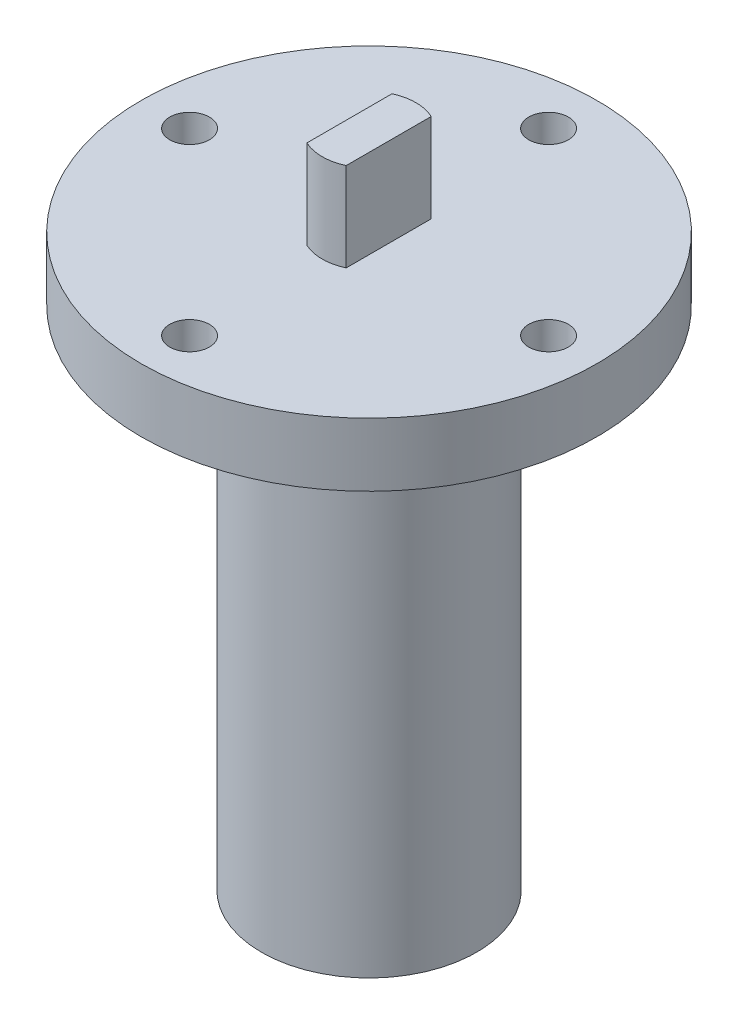
ISO-10303-21;
HEADER;
FILE_DESCRIPTION(('STEP AP214'),'2;1');
FILE_NAME('part.step','',(''),(''),'','','');
FILE_SCHEMA(('AUTOMOTIVE_DESIGN { 1 0 10303 214 1 1 1 1 }'));
ENDSEC;
DATA;
#1=APPLICATION_CONTEXT('core data for automotive mechanical design processes');
#2=APPLICATION_PROTOCOL_DEFINITION('international standard','automotive_design',2000,#1);
#3=PRODUCT_CONTEXT('',#1,'mechanical');
#4=PRODUCT('Part','Part','',(#3));
#5=PRODUCT_RELATED_PRODUCT_CATEGORY('part','',(#4));
#6=PRODUCT_DEFINITION_FORMATION('','',#4);
#7=PRODUCT_DEFINITION_CONTEXT('part definition',#1,'design');
#8=PRODUCT_DEFINITION('design','',#6,#7);
#9=PRODUCT_DEFINITION_SHAPE('','',#8);
#10=(LENGTH_UNIT() NAMED_UNIT(*) SI_UNIT(.MILLI.,.METRE.));
#11=(NAMED_UNIT(*) PLANE_ANGLE_UNIT() SI_UNIT($,.RADIAN.));
#12=(NAMED_UNIT(*) SI_UNIT($,.STERADIAN.) SOLID_ANGLE_UNIT());
#13=UNCERTAINTY_MEASURE_WITH_UNIT(LENGTH_MEASURE(1.E-05),#10,'distance_accuracy_value','');
#14=(GEOMETRIC_REPRESENTATION_CONTEXT(3) GLOBAL_UNCERTAINTY_ASSIGNED_CONTEXT((#13)) GLOBAL_UNIT_ASSIGNED_CONTEXT((#10,
#11,#12)) REPRESENTATION_CONTEXT('',''));
#15=CARTESIAN_POINT('',(0.,0.,0.));
#16=DIRECTION('',(0.,0.,1.));
#17=DIRECTION('',(1.,0.,0.));
#18=AXIS2_PLACEMENT_3D('',#15,#16,#17);
#19=CARTESIAN_POINT('',(0.,6.35,0.));
#20=DIRECTION('',(0.,1.,0.));
#21=DIRECTION('',(0.,0.,1.));
#22=AXIS2_PLACEMENT_3D('',#19,#20,#21);
#23=PLANE('',#22);
#24=CARTESIAN_POINT('',(18.,6.35,-1.88539992297529E-13));
#25=DIRECTION('',(0.,1.,0.));
#26=DIRECTION('',(0.,0.,1.));
#27=AXIS2_PLACEMENT_3D('',#24,#25,#26);
#28=CIRCLE('',#27,1.984375);
#29=CARTESIAN_POINT('',(18.,6.35,1.98437499999981));
#30=VERTEX_POINT('',#29);
#31=EDGE_CURVE('E217',#30,#30,#28,.T.);
#32=ORIENTED_EDGE('',*,*,#31,.F.);
#33=EDGE_LOOP('',(#32));
#34=FACE_BOUND('',#33,.T.);
#35=CARTESIAN_POINT('',(0.,6.35,18.));
#36=DIRECTION('',(0.,1.,0.));
#37=DIRECTION('',(0.,0.,1.));
#38=AXIS2_PLACEMENT_3D('',#35,#36,#37);
#39=CIRCLE('',#38,1.984375);
#40=CARTESIAN_POINT('',(0.,6.35,19.984375));
#41=VERTEX_POINT('',#40);
#42=EDGE_CURVE('E211',#41,#41,#39,.T.);
#43=ORIENTED_EDGE('',*,*,#42,.F.);
#44=EDGE_LOOP('',(#43));
#45=FACE_BOUND('',#44,.T.);
#46=CARTESIAN_POINT('',(-18.,6.35,0.));
#47=DIRECTION('',(0.,1.,0.));
#48=DIRECTION('',(0.,0.,1.));
#49=AXIS2_PLACEMENT_3D('',#46,#47,#48);
#50=CIRCLE('',#49,1.984375);
#51=CARTESIAN_POINT('',(-18.,6.35,1.98437500000006));
#52=VERTEX_POINT('',#51);
#53=EDGE_CURVE('E205',#52,#52,#50,.T.);
#54=ORIENTED_EDGE('',*,*,#53,.F.);
#55=EDGE_LOOP('',(#54));
#56=FACE_BOUND('',#55,.T.);
#57=CARTESIAN_POINT('',(0.,6.35,-18.));
#58=DIRECTION('',(0.,1.,0.));
#59=DIRECTION('',(0.,0.,1.));
#60=AXIS2_PLACEMENT_3D('',#57,#58,#59);
#61=CIRCLE('',#60,1.984375);
#62=CARTESIAN_POINT('',(0.,6.35,-16.015625));
#63=VERTEX_POINT('',#62);
#64=EDGE_CURVE('E196',#63,#63,#61,.T.);
#65=ORIENTED_EDGE('',*,*,#64,.F.);
#66=EDGE_LOOP('',(#65));
#67=FACE_BOUND('',#66,.T.);
#68=CARTESIAN_POINT('',(0.,6.35,0.));
#69=DIRECTION('',(0.,1.,0.));
#70=DIRECTION('',(0.,0.,1.));
#71=AXIS2_PLACEMENT_3D('',#68,#69,#70);
#72=CIRCLE('',#71,22.86);
#73=CARTESIAN_POINT('',(0.,6.35,22.86));
#74=VERTEX_POINT('',#73);
#75=EDGE_CURVE('E130',#74,#74,#72,.T.);
#76=ORIENTED_EDGE('',*,*,#75,.T.);
#77=EDGE_LOOP('',(#76));
#78=FACE_BOUND('',#77,.T.);
#79=CARTESIAN_POINT('',(0.,6.35,0.));
#80=DIRECTION('',(0.,1.,0.));
#81=DIRECTION('',(0.,0.,1.));
#82=AXIS2_PLACEMENT_3D('',#79,#80,#81);
#83=CIRCLE('',#82,4.699);
#84=CARTESIAN_POINT('',(1.9685,6.35,-4.26680310654242));
#85=VERTEX_POINT('',#84);
#86=CARTESIAN_POINT('',(-1.9685,6.35,-4.26680310654242));
#87=VERTEX_POINT('',#86);
#88=EDGE_CURVE('E109',#85,#87,#83,.T.);
#89=ORIENTED_EDGE('',*,*,#88,.F.);
#90=DIRECTION('',(0.,0.,1.));
#91=VECTOR('',#90,1.);
#92=CARTESIAN_POINT('',(1.9685,6.35,0.));
#93=LINE('',#92,#91);
#94=CARTESIAN_POINT('',(1.9685,6.35,4.26680310654242));
#95=VERTEX_POINT('',#94);
#96=EDGE_CURVE('E55',#85,#95,#93,.T.);
#97=ORIENTED_EDGE('',*,*,#96,.T.);
#98=CARTESIAN_POINT('',(-1.9685,6.35,4.26680310654241));
#99=VERTEX_POINT('',#98);
#100=EDGE_CURVE('E60',#99,#95,#83,.T.);
#101=ORIENTED_EDGE('',*,*,#100,.F.);
#102=DIRECTION('',(0.,0.,1.));
#103=VECTOR('',#102,1.);
#104=CARTESIAN_POINT('',(-1.9685,6.35,0.));
#105=LINE('',#104,#103);
#106=EDGE_CURVE('E107',#87,#99,#105,.T.);
#107=ORIENTED_EDGE('',*,*,#106,.F.);
#108=EDGE_LOOP('',(#89,#97,#101,#107));
#109=FACE_BOUND('',#108,.T.);
#110=ADVANCED_FACE('F39',(#34,#45,#56,#67,#78,#109),#23,.T.);
#111=CARTESIAN_POINT('',(0.,6.35,0.));
#112=DIRECTION('',(0.,-1.,0.));
#113=DIRECTION('',(0.,0.,-1.));
#114=AXIS2_PLACEMENT_3D('',#111,#112,#113);
#115=CYLINDRICAL_SURFACE('',#114,22.86);
#116=ORIENTED_EDGE('',*,*,#75,.F.);
#117=EDGE_LOOP('',(#116));
#118=FACE_BOUND('',#117,.T.);
#119=CARTESIAN_POINT('',(0.,0.,0.));
#120=DIRECTION('',(0.,1.,0.));
#121=DIRECTION('',(0.,0.,1.));
#122=AXIS2_PLACEMENT_3D('',#119,#120,#121);
#123=CIRCLE('',#122,22.86);
#124=CARTESIAN_POINT('',(0.,0.,22.86));
#125=VERTEX_POINT('',#124);
#126=EDGE_CURVE('E88',#125,#125,#123,.T.);
#127=ORIENTED_EDGE('',*,*,#126,.T.);
#128=EDGE_LOOP('',(#127));
#129=FACE_BOUND('',#128,.T.);
#130=ADVANCED_FACE('F158',(#118,#129),#115,.T.);
#131=CARTESIAN_POINT('',(0.,0.,0.));
#132=DIRECTION('',(0.,1.,0.));
#133=DIRECTION('',(0.,0.,1.));
#134=AXIS2_PLACEMENT_3D('',#131,#132,#133);
#135=PLANE('',#134);
#136=CARTESIAN_POINT('',(18.,0.,-1.88539992297529E-13));
#137=DIRECTION('',(0.,1.,0.));
#138=DIRECTION('',(0.,0.,1.));
#139=AXIS2_PLACEMENT_3D('',#136,#137,#138);
#140=CIRCLE('',#139,1.984375);
#141=CARTESIAN_POINT('',(18.,0.,1.98437499999981));
#142=VERTEX_POINT('',#141);
#143=EDGE_CURVE('E179',#142,#142,#140,.T.);
#144=ORIENTED_EDGE('',*,*,#143,.T.);
#145=EDGE_LOOP('',(#144));
#146=FACE_BOUND('',#145,.T.);
#147=CARTESIAN_POINT('',(0.,0.,18.));
#148=DIRECTION('',(0.,1.,0.));
#149=DIRECTION('',(0.,0.,1.));
#150=AXIS2_PLACEMENT_3D('',#147,#148,#149);
#151=CIRCLE('',#150,1.984375);
#152=CARTESIAN_POINT('',(0.,0.,19.984375));
#153=VERTEX_POINT('',#152);
#154=EDGE_CURVE('E183',#153,#153,#151,.T.);
#155=ORIENTED_EDGE('',*,*,#154,.T.);
#156=EDGE_LOOP('',(#155));
#157=FACE_BOUND('',#156,.T.);
#158=CARTESIAN_POINT('',(-18.,0.,0.));
#159=DIRECTION('',(0.,1.,0.));
#160=DIRECTION('',(0.,0.,1.));
#161=AXIS2_PLACEMENT_3D('',#158,#159,#160);
#162=CIRCLE('',#161,1.984375);
#163=CARTESIAN_POINT('',(-18.,0.,1.98437500000006));
#164=VERTEX_POINT('',#163);
#165=EDGE_CURVE('E187',#164,#164,#162,.T.);
#166=ORIENTED_EDGE('',*,*,#165,.T.);
#167=EDGE_LOOP('',(#166));
#168=FACE_BOUND('',#167,.T.);
#169=CARTESIAN_POINT('',(0.,0.,-18.));
#170=DIRECTION('',(0.,1.,0.));
#171=DIRECTION('',(0.,0.,1.));
#172=AXIS2_PLACEMENT_3D('',#169,#170,#171);
#173=CIRCLE('',#172,1.984375);
#174=CARTESIAN_POINT('',(0.,0.,-16.015625));
#175=VERTEX_POINT('',#174);
#176=EDGE_CURVE('E191',#175,#175,#173,.T.);
#177=ORIENTED_EDGE('',*,*,#176,.T.);
#178=EDGE_LOOP('',(#177));
#179=FACE_BOUND('',#178,.T.);
#180=CARTESIAN_POINT('',(0.,0.,0.));
#181=DIRECTION('',(0.,1.,0.));
#182=DIRECTION('',(0.,0.,1.));
#183=AXIS2_PLACEMENT_3D('',#180,#181,#182);
#184=CIRCLE('',#183,14.605);
#185=CARTESIAN_POINT('',(0.,0.,14.605));
#186=VERTEX_POINT('',#185);
#187=EDGE_CURVE('E11',#186,#186,#184,.T.);
#188=ORIENTED_EDGE('',*,*,#187,.T.);
#189=EDGE_LOOP('',(#188));
#190=FACE_BOUND('',#189,.T.);
#191=ORIENTED_EDGE('',*,*,#126,.F.);
#192=EDGE_LOOP('',(#191));
#193=FACE_BOUND('',#192,.T.);
#194=ADVANCED_FACE('F164',(#146,#157,#168,#179,#190,#193),#135,.F.);
#195=CARTESIAN_POINT('',(1.9685,15.24,0.));
#196=DIRECTION('',(1.,0.,0.));
#197=DIRECTION('',(0.,0.,-1.));
#198=AXIS2_PLACEMENT_3D('',#195,#196,#197);
#199=PLANE('',#198);
#200=ORIENTED_EDGE('',*,*,#96,.F.);
#201=DIRECTION('',(0.,-1.,0.));
#202=VECTOR('',#201,1.);
#203=CARTESIAN_POINT('',(1.9685,15.24,-4.26680310654242));
#204=LINE('',#203,#202);
#205=CARTESIAN_POINT('',(1.9685,15.24,-4.26680310654242));
#206=VERTEX_POINT('',#205);
#207=EDGE_CURVE('E80',#206,#85,#204,.T.);
#208=ORIENTED_EDGE('',*,*,#207,.F.);
#209=DIRECTION('',(0.,0.,1.));
#210=VECTOR('',#209,1.);
#211=CARTESIAN_POINT('',(1.9685,15.24,0.));
#212=LINE('',#211,#210);
#213=CARTESIAN_POINT('',(1.9685,15.24,4.26680310654242));
#214=VERTEX_POINT('',#213);
#215=EDGE_CURVE('E84',#206,#214,#212,.T.);
#216=ORIENTED_EDGE('',*,*,#215,.T.);
#217=DIRECTION('',(0.,-1.,0.));
#218=VECTOR('',#217,1.);
#219=CARTESIAN_POINT('',(1.9685,15.24,4.26680310654242));
#220=LINE('',#219,#218);
#221=EDGE_CURVE('E121',#214,#95,#220,.T.);
#222=ORIENTED_EDGE('',*,*,#221,.T.);
#223=EDGE_LOOP('',(#200,#208,#216,#222));
#224=FACE_BOUND('',#223,.T.);
#225=ADVANCED_FACE('F82',(#224),#199,.T.);
#226=CARTESIAN_POINT('',(0.,15.24,0.));
#227=DIRECTION('',(0.,-1.,0.));
#228=DIRECTION('',(0.,0.,-1.));
#229=AXIS2_PLACEMENT_3D('',#226,#227,#228);
#230=CYLINDRICAL_SURFACE('',#229,4.699);
#231=ORIENTED_EDGE('',*,*,#88,.T.);
#232=DIRECTION('',(0.,-1.,0.));
#233=VECTOR('',#232,1.);
#234=CARTESIAN_POINT('',(-1.9685,15.24,-4.26680310654242));
#235=LINE('',#234,#233);
#236=CARTESIAN_POINT('',(-1.9685,15.24,-4.26680310654242));
#237=VERTEX_POINT('',#236);
#238=EDGE_CURVE('E89',#237,#87,#235,.T.);
#239=ORIENTED_EDGE('',*,*,#238,.F.);
#240=CARTESIAN_POINT('',(0.,15.24,0.));
#241=DIRECTION('',(0.,1.,0.));
#242=DIRECTION('',(0.,0.,1.));
#243=AXIS2_PLACEMENT_3D('',#240,#241,#242);
#244=CIRCLE('',#243,4.699);
#245=EDGE_CURVE('E92',#206,#237,#244,.T.);
#246=ORIENTED_EDGE('',*,*,#245,.F.);
#247=ORIENTED_EDGE('',*,*,#207,.T.);
#248=EDGE_LOOP('',(#231,#239,#246,#247));
#249=FACE_BOUND('',#248,.T.);
#250=ADVANCED_FACE('F93',(#249),#230,.T.);
#251=CARTESIAN_POINT('',(-1.9685,15.24,0.));
#252=DIRECTION('',(1.,0.,0.));
#253=DIRECTION('',(0.,0.,-1.));
#254=AXIS2_PLACEMENT_3D('',#251,#252,#253);
#255=PLANE('',#254);
#256=ORIENTED_EDGE('',*,*,#106,.T.);
#257=DIRECTION('',(0.,-1.,0.));
#258=VECTOR('',#257,1.);
#259=CARTESIAN_POINT('',(-1.9685,15.24,4.26680310654241));
#260=LINE('',#259,#258);
#261=CARTESIAN_POINT('',(-1.9685,15.24,4.26680310654241));
#262=VERTEX_POINT('',#261);
#263=EDGE_CURVE('E124',#262,#99,#260,.T.);
#264=ORIENTED_EDGE('',*,*,#263,.F.);
#265=DIRECTION('',(0.,0.,1.));
#266=VECTOR('',#265,1.);
#267=CARTESIAN_POINT('',(-1.9685,15.24,0.));
#268=LINE('',#267,#266);
#269=EDGE_CURVE('E98',#237,#262,#268,.T.);
#270=ORIENTED_EDGE('',*,*,#269,.F.);
#271=ORIENTED_EDGE('',*,*,#238,.T.);
#272=EDGE_LOOP('',(#256,#264,#270,#271));
#273=FACE_BOUND('',#272,.T.);
#274=ADVANCED_FACE('F241',(#273),#255,.F.);
#275=ORIENTED_EDGE('',*,*,#100,.T.);
#276=ORIENTED_EDGE('',*,*,#221,.F.);
#277=EDGE_CURVE('E100',#262,#214,#244,.T.);
#278=ORIENTED_EDGE('',*,*,#277,.F.);
#279=ORIENTED_EDGE('',*,*,#263,.T.);
#280=EDGE_LOOP('',(#275,#276,#278,#279));
#281=FACE_BOUND('',#280,.T.);
#282=ADVANCED_FACE('F239',(#281),#230,.T.);
#283=CARTESIAN_POINT('',(0.,15.24,0.));
#284=DIRECTION('',(0.,1.,0.));
#285=DIRECTION('',(0.,0.,1.));
#286=AXIS2_PLACEMENT_3D('',#283,#284,#285);
#287=PLANE('',#286);
#288=ORIENTED_EDGE('',*,*,#215,.F.);
#289=ORIENTED_EDGE('',*,*,#245,.T.);
#290=ORIENTED_EDGE('',*,*,#269,.T.);
#291=ORIENTED_EDGE('',*,*,#277,.T.);
#292=EDGE_LOOP('',(#288,#289,#290,#291));
#293=FACE_BOUND('',#292,.T.);
#294=ADVANCED_FACE('F101',(#293),#287,.T.);
#295=CARTESIAN_POINT('',(0.,-50.8,0.));
#296=DIRECTION('',(0.,1.,0.));
#297=DIRECTION('',(0.,0.,1.));
#298=AXIS2_PLACEMENT_3D('',#295,#296,#297);
#299=CYLINDRICAL_SURFACE('',#298,10.795);
#300=CARTESIAN_POINT('',(0.,-3.81000000000002,0.));
#301=DIRECTION('',(0.,1.,0.));
#302=DIRECTION('',(0.,0.,1.));
#303=AXIS2_PLACEMENT_3D('',#300,#301,#302);
#304=CIRCLE('',#303,10.795);
#305=CARTESIAN_POINT('',(0.,-3.81000000000002,10.795));
#306=VERTEX_POINT('',#305);
#307=EDGE_CURVE('E48',#306,#306,#304,.F.);
#308=ORIENTED_EDGE('',*,*,#307,.T.);
#309=EDGE_LOOP('',(#308));
#310=FACE_BOUND('',#309,.T.);
#311=CARTESIAN_POINT('',(0.,-50.8,0.));
#312=DIRECTION('',(0.,-1.,0.));
#313=DIRECTION('',(0.,0.,-1.));
#314=AXIS2_PLACEMENT_3D('',#311,#312,#313);
#315=CIRCLE('',#314,10.795);
#316=CARTESIAN_POINT('',(0.,-50.8,-10.795));
#317=VERTEX_POINT('',#316);
#318=EDGE_CURVE('E111',#317,#317,#315,.T.);
#319=ORIENTED_EDGE('',*,*,#318,.F.);
#320=EDGE_LOOP('',(#319));
#321=FACE_BOUND('',#320,.T.);
#322=ADVANCED_FACE('F140',(#310,#321),#299,.T.);
#323=CARTESIAN_POINT('',(0.,-50.8,0.));
#324=DIRECTION('',(0.,-1.,0.));
#325=DIRECTION('',(0.,0.,-1.));
#326=AXIS2_PLACEMENT_3D('',#323,#324,#325);
#327=PLANE('',#326);
#328=ORIENTED_EDGE('',*,*,#318,.T.);
#329=EDGE_LOOP('',(#328));
#330=FACE_BOUND('',#329,.T.);
#331=ADVANCED_FACE('F145',(#330),#327,.T.);
#332=CARTESIAN_POINT('',(0.,-3.81000000000002,0.));
#333=DIRECTION('',(0.,1.,0.));
#334=DIRECTION('',(0.,0.,1.));
#335=AXIS2_PLACEMENT_3D('',#332,#333,#334);
#336=CONICAL_SURFACE('',#335,10.795,0.785398163397443);
#337=ORIENTED_EDGE('',*,*,#187,.F.);
#338=EDGE_LOOP('',(#337));
#339=FACE_BOUND('',#338,.T.);
#340=ORIENTED_EDGE('',*,*,#307,.F.);
#341=EDGE_LOOP('',(#340));
#342=FACE_BOUND('',#341,.T.);
#343=ADVANCED_FACE('F41',(#339,#342),#336,.T.);
#344=CARTESIAN_POINT('',(0.,6.35,-18.));
#345=DIRECTION('',(0.,1.,0.));
#346=DIRECTION('',(0.,0.,1.));
#347=AXIS2_PLACEMENT_3D('',#344,#345,#346);
#348=CYLINDRICAL_SURFACE('',#347,1.984375);
#349=ORIENTED_EDGE('',*,*,#176,.F.);
#350=EDGE_LOOP('',(#349));
#351=FACE_BOUND('',#350,.T.);
#352=ORIENTED_EDGE('',*,*,#64,.T.);
#353=EDGE_LOOP('',(#352));
#354=FACE_BOUND('',#353,.T.);
#355=ADVANCED_FACE('F144',(#351,#354),#348,.F.);
#356=CARTESIAN_POINT('',(-18.,6.35,0.));
#357=DIRECTION('',(0.,1.,0.));
#358=DIRECTION('',(0.,0.,1.));
#359=AXIS2_PLACEMENT_3D('',#356,#357,#358);
#360=CYLINDRICAL_SURFACE('',#359,1.984375);
#361=ORIENTED_EDGE('',*,*,#165,.F.);
#362=EDGE_LOOP('',(#361));
#363=FACE_BOUND('',#362,.T.);
#364=ORIENTED_EDGE('',*,*,#53,.T.);
#365=EDGE_LOOP('',(#364));
#366=FACE_BOUND('',#365,.T.);
#367=ADVANCED_FACE('F151',(#363,#366),#360,.F.);
#368=CARTESIAN_POINT('',(0.,6.35,18.));
#369=DIRECTION('',(0.,1.,0.));
#370=DIRECTION('',(0.,0.,1.));
#371=AXIS2_PLACEMENT_3D('',#368,#369,#370);
#372=CYLINDRICAL_SURFACE('',#371,1.984375);
#373=ORIENTED_EDGE('',*,*,#154,.F.);
#374=EDGE_LOOP('',(#373));
#375=FACE_BOUND('',#374,.T.);
#376=ORIENTED_EDGE('',*,*,#42,.T.);
#377=EDGE_LOOP('',(#376));
#378=FACE_BOUND('',#377,.T.);
#379=ADVANCED_FACE('F223',(#375,#378),#372,.F.);
#380=CARTESIAN_POINT('',(18.,6.35,-1.88539992297529E-13));
#381=DIRECTION('',(0.,1.,0.));
#382=DIRECTION('',(0.,0.,1.));
#383=AXIS2_PLACEMENT_3D('',#380,#381,#382);
#384=CYLINDRICAL_SURFACE('',#383,1.984375);
#385=ORIENTED_EDGE('',*,*,#143,.F.);
#386=EDGE_LOOP('',(#385));
#387=FACE_BOUND('',#386,.T.);
#388=ORIENTED_EDGE('',*,*,#31,.T.);
#389=EDGE_LOOP('',(#388));
#390=FACE_BOUND('',#389,.T.);
#391=ADVANCED_FACE('F221',(#387,#390),#384,.F.);
#392=CLOSED_SHELL('',(#110,#130,#194,#225,#250,#274,#282,#294,#322,#331,#343,#355,#367,#379,#391));
#393=MANIFOLD_SOLID_BREP('B2',#392);
#394=ADVANCED_BREP_SHAPE_REPRESENTATION('',(#18,#393),#14);
#395=SHAPE_DEFINITION_REPRESENTATION(#9,#394);
ENDSEC;
END-ISO-10303-21;
